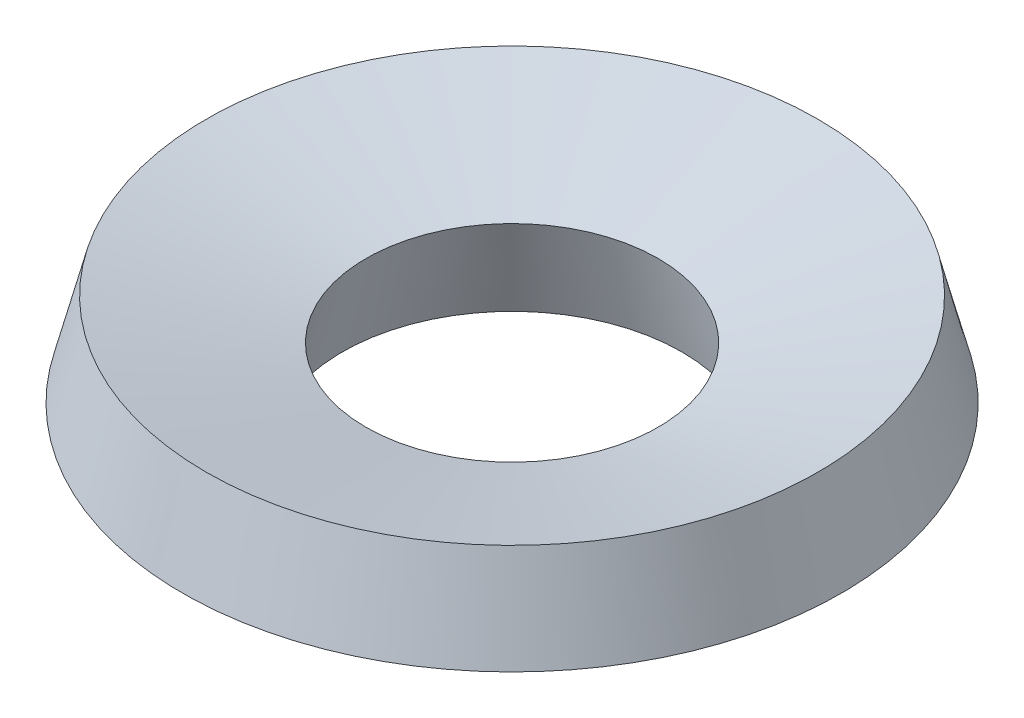
ISO-10303-21;
HEADER;
FILE_DESCRIPTION(('STEP AP214'),'2;1');
FILE_NAME('part.step','',(''),(''),'','','');
FILE_SCHEMA(('AUTOMOTIVE_DESIGN { 1 0 10303 214 1 1 1 1 }'));
ENDSEC;
DATA;
#1=APPLICATION_CONTEXT('core data for automotive mechanical design processes');
#2=APPLICATION_PROTOCOL_DEFINITION('international standard','automotive_design',2000,#1);
#3=PRODUCT_CONTEXT('',#1,'mechanical');
#4=PRODUCT('Part','Part','',(#3));
#5=PRODUCT_RELATED_PRODUCT_CATEGORY('part','',(#4));
#6=PRODUCT_DEFINITION_FORMATION('','',#4);
#7=PRODUCT_DEFINITION_CONTEXT('part definition',#1,'design');
#8=PRODUCT_DEFINITION('design','',#6,#7);
#9=PRODUCT_DEFINITION_SHAPE('','',#8);
#10=(LENGTH_UNIT() NAMED_UNIT(*) SI_UNIT(.MILLI.,.METRE.));
#11=(NAMED_UNIT(*) PLANE_ANGLE_UNIT() SI_UNIT($,.RADIAN.));
#12=(NAMED_UNIT(*) SI_UNIT($,.STERADIAN.) SOLID_ANGLE_UNIT());
#13=UNCERTAINTY_MEASURE_WITH_UNIT(LENGTH_MEASURE(1.E-05),#10,'distance_accuracy_value','');
#14=(GEOMETRIC_REPRESENTATION_CONTEXT(3) GLOBAL_UNCERTAINTY_ASSIGNED_CONTEXT((#13)) GLOBAL_UNIT_ASSIGNED_CONTEXT((#10,
#11,#12)) REPRESENTATION_CONTEXT('',''));
#15=CARTESIAN_POINT('',(0.,0.,0.));
#16=DIRECTION('',(0.,0.,1.));
#17=DIRECTION('',(1.,0.,0.));
#18=AXIS2_PLACEMENT_3D('',#15,#16,#17);
#19=CARTESIAN_POINT('',(0.,5.00000000004071,0.));
#20=DIRECTION('',(0.,1.00000000000001,0.));
#21=DIRECTION('',(-1.00000000000002,0.,0.));
#22=AXIS2_PLACEMENT_3D('',#19,#20,#21);
#23=CONICAL_SURFACE('',#22,16.4709302325896,1.32035323718);
#24=CARTESIAN_POINT('',(0.,2.79999999999972,0.));
#25=DIRECTION('',(0.,-1.00000000000001,0.));
#26=DIRECTION('',(0.,0.,-1.00000000000002));
#27=AXIS2_PLACEMENT_3D('',#24,#25,#26);
#28=CIRCLE('',#27,7.87093023255887);
#29=CARTESIAN_POINT('',(0.,2.79999999999972,-7.87093023255905));
#30=VERTEX_POINT('',#29);
#31=EDGE_CURVE('E25',#30,#30,#28,.T.);
#32=ORIENTED_EDGE('',*,*,#31,.T.);
#33=EDGE_LOOP('',(#32));
#34=FACE_BOUND('',#33,.T.);
#35=CARTESIAN_POINT('',(0.,4.99999999998771,0.));
#36=DIRECTION('',(0.,-1.00000000000001,0.));
#37=DIRECTION('',(0.,0.,-1.00000000000002));
#38=AXIS2_PLACEMENT_3D('',#35,#36,#37);
#39=CIRCLE('',#38,16.4709302325519);
#40=CARTESIAN_POINT('',(1.05944847533141E-13,4.99999999998772,-16.4709302325522));
#41=VERTEX_POINT('',#40);
#42=EDGE_CURVE('E34',#41,#41,#39,.T.);
#43=ORIENTED_EDGE('',*,*,#42,.F.);
#44=EDGE_LOOP('',(#43));
#45=FACE_BOUND('',#44,.T.);
#46=ADVANCED_FACE('F22',(#34,#45),#23,.F.);
#47=CARTESIAN_POINT('',(0.,-2.2000000000003,0.));
#48=DIRECTION('',(0.,-1.00000000000001,0.));
#49=DIRECTION('',(1.00000000000002,0.,0.));
#50=AXIS2_PLACEMENT_3D('',#47,#48,#49);
#51=CONICAL_SURFACE('',#50,9.14999999999886,0.250443089611);
#52=CARTESIAN_POINT('',(0.,-2.19999999999939,0.));
#53=DIRECTION('',(0.,1.00000000000001,0.));
#54=DIRECTION('',(0.,0.,-1.00000000000002));
#55=AXIS2_PLACEMENT_3D('',#52,#53,#54);
#56=CIRCLE('',#55,9.14999999999984);
#57=CARTESIAN_POINT('',(0.,-2.19999999999939,-9.15000000000001));
#58=VERTEX_POINT('',#57);
#59=EDGE_CURVE('E29',#58,#58,#56,.T.);
#60=ORIENTED_EDGE('',*,*,#59,.F.);
#61=EDGE_LOOP('',(#60));
#62=FACE_BOUND('',#61,.T.);
#63=ORIENTED_EDGE('',*,*,#31,.F.);
#64=EDGE_LOOP('',(#63));
#65=FACE_BOUND('',#64,.T.);
#66=ADVANCED_FACE('F44',(#62,#65),#51,.F.);
#67=CARTESIAN_POINT('',(0.,-2.692290834716E-12,0.));
#68=DIRECTION('',(0.,-1.00000000000001,0.));
#69=DIRECTION('',(1.00000000000002,0.,0.));
#70=AXIS2_PLACEMENT_3D('',#67,#68,#69);
#71=CONICAL_SURFACE('',#70,17.7499999999895,0.250443089611);
#72=ORIENTED_EDGE('',*,*,#42,.T.);
#73=EDGE_LOOP('',(#72));
#74=FACE_BOUND('',#73,.T.);
#75=CARTESIAN_POINT('',(0.,3.11001224773122E-11,0.));
#76=DIRECTION('',(0.,1.00000000000001,0.));
#77=DIRECTION('',(0.,0.,-1.00000000000002));
#78=AXIS2_PLACEMENT_3D('',#75,#76,#77);
#79=CIRCLE('',#78,17.749999999992);
#80=CARTESIAN_POINT('',(0.,3.11005561581812E-11,-17.7499999999924));
#81=VERTEX_POINT('',#80);
#82=EDGE_CURVE('E12',#81,#81,#79,.F.);
#83=ORIENTED_EDGE('',*,*,#82,.F.);
#84=EDGE_LOOP('',(#83));
#85=FACE_BOUND('',#84,.T.);
#86=ADVANCED_FACE('F46',(#74,#85),#71,.T.);
#87=CARTESIAN_POINT('',(0.,3.11001224773122E-11,0.));
#88=DIRECTION('',(0.,1.00000000000001,0.));
#89=DIRECTION('',(-1.00000000000002,0.,0.));
#90=AXIS2_PLACEMENT_3D('',#87,#88,#89);
#91=CONICAL_SURFACE('',#90,17.749999999992,1.32035323718);
#92=ORIENTED_EDGE('',*,*,#82,.T.);
#93=EDGE_LOOP('',(#92));
#94=FACE_BOUND('',#93,.T.);
#95=ORIENTED_EDGE('',*,*,#59,.T.);
#96=EDGE_LOOP('',(#95));
#97=FACE_BOUND('',#96,.T.);
#98=ADVANCED_FACE('F53',(#94,#97),#91,.T.);
#99=CLOSED_SHELL('',(#46,#66,#86,#98));
#100=MANIFOLD_SOLID_BREP('B1',#99);
#101=ADVANCED_BREP_SHAPE_REPRESENTATION('',(#18,#100),#14);
#102=SHAPE_DEFINITION_REPRESENTATION(#9,#101);
ENDSEC;
END-ISO-10303-21;
